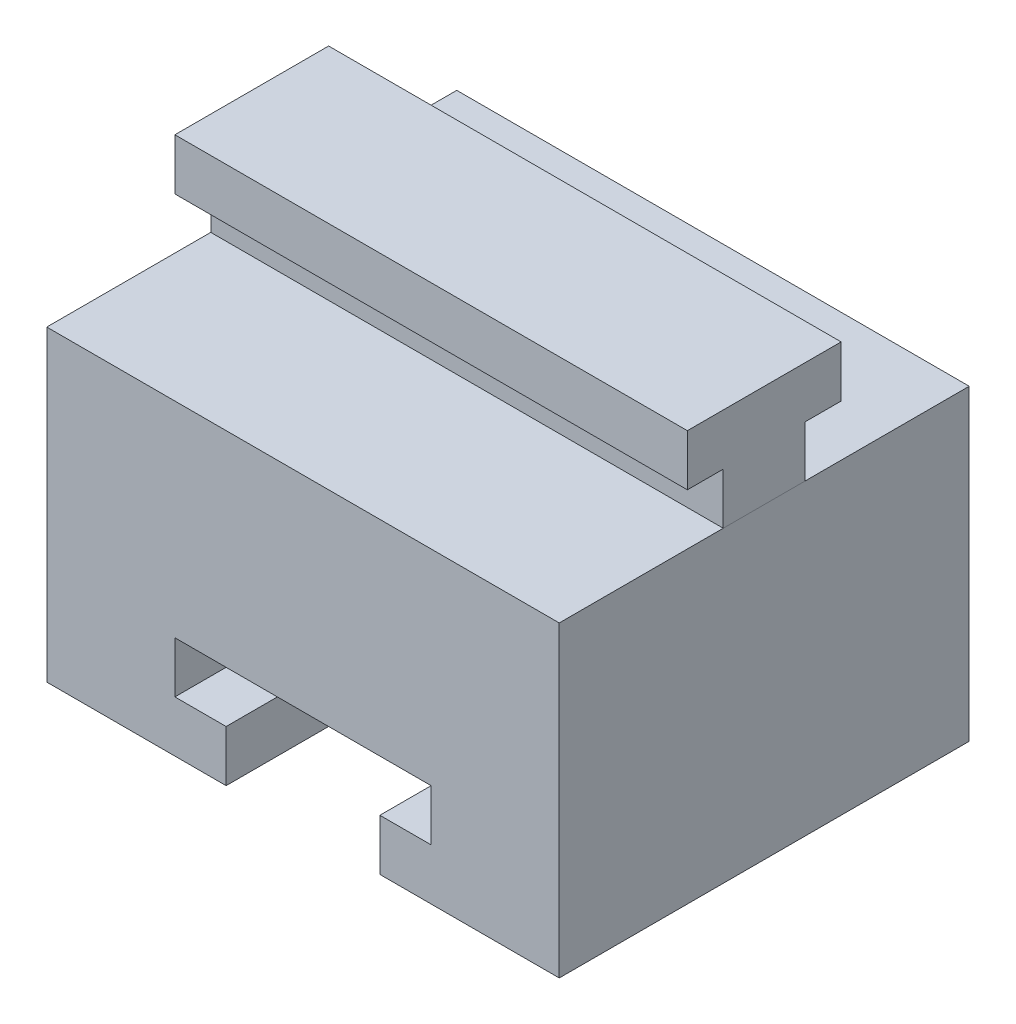
ISO-10303-21;
HEADER;
FILE_DESCRIPTION(('STEP AP214'),'2;1');
FILE_NAME('part.step','',(''),(''),'','','');
FILE_SCHEMA(('AUTOMOTIVE_DESIGN { 1 0 10303 214 1 1 1 1 }'));
ENDSEC;
DATA;
#1=APPLICATION_CONTEXT('core data for automotive mechanical design processes');
#2=APPLICATION_PROTOCOL_DEFINITION('international standard','automotive_design',2000,#1);
#3=PRODUCT_CONTEXT('',#1,'mechanical');
#4=PRODUCT('Part','Part','',(#3));
#5=PRODUCT_RELATED_PRODUCT_CATEGORY('part','',(#4));
#6=PRODUCT_DEFINITION_FORMATION('','',#4);
#7=PRODUCT_DEFINITION_CONTEXT('part definition',#1,'design');
#8=PRODUCT_DEFINITION('design','',#6,#7);
#9=PRODUCT_DEFINITION_SHAPE('','',#8);
#10=(LENGTH_UNIT() NAMED_UNIT(*) SI_UNIT(.MILLI.,.METRE.));
#11=(NAMED_UNIT(*) PLANE_ANGLE_UNIT() SI_UNIT($,.RADIAN.));
#12=(NAMED_UNIT(*) SI_UNIT($,.STERADIAN.) SOLID_ANGLE_UNIT());
#13=UNCERTAINTY_MEASURE_WITH_UNIT(LENGTH_MEASURE(1.E-05),#10,'distance_accuracy_value','');
#14=(GEOMETRIC_REPRESENTATION_CONTEXT(3) GLOBAL_UNCERTAINTY_ASSIGNED_CONTEXT((#13)) GLOBAL_UNIT_ASSIGNED_CONTEXT((#10,
#11,#12)) REPRESENTATION_CONTEXT('',''));
#15=CARTESIAN_POINT('',(0.,0.,0.));
#16=DIRECTION('',(0.,0.,1.));
#17=DIRECTION('',(1.,0.,0.));
#18=AXIS2_PLACEMENT_3D('',#15,#16,#17);
#19=CARTESIAN_POINT('',(12.2857142857143,8.14285714285714,24.));
#20=DIRECTION('',(0.,0.,-1.));
#21=DIRECTION('',(-1.,0.,0.));
#22=AXIS2_PLACEMENT_3D('',#19,#20,#21);
#23=PLANE('',#22);
#24=DIRECTION('',(-1.,0.,0.));
#25=VECTOR('',#24,1.);
#26=CARTESIAN_POINT('',(12.2857142857143,13.1395488489312,24.));
#27=LINE('',#26,#25);
#28=CARTESIAN_POINT('',(12.2857142857143,13.1395488489312,24.));
#29=VERTEX_POINT('',#28);
#30=CARTESIAN_POINT('',(-37.7142857142857,13.1395488489312,24.));
#31=VERTEX_POINT('',#30);
#32=EDGE_CURVE('E129',#29,#31,#27,.T.);
#33=ORIENTED_EDGE('',*,*,#32,.T.);
#34=DIRECTION('',(0.,-1.,0.));
#35=VECTOR('',#34,1.);
#36=CARTESIAN_POINT('',(-37.7142857142857,8.14285714285714,24.));
#37=LINE('',#36,#35);
#38=CARTESIAN_POINT('',(-37.7142857142857,8.14285714285714,24.));
#39=VERTEX_POINT('',#38);
#40=EDGE_CURVE('E123',#31,#39,#37,.T.);
#41=ORIENTED_EDGE('',*,*,#40,.T.);
#42=DIRECTION('',(-1.,0.,0.));
#43=VECTOR('',#42,1.);
#44=CARTESIAN_POINT('',(12.2857142857143,8.14285714285714,24.));
#45=LINE('',#44,#43);
#46=CARTESIAN_POINT('',(12.2857142857143,8.14285714285714,24.));
#47=VERTEX_POINT('',#46);
#48=EDGE_CURVE('E12',#47,#39,#45,.T.);
#49=ORIENTED_EDGE('',*,*,#48,.F.);
#50=DIRECTION('',(0.,-1.,0.));
#51=VECTOR('',#50,1.);
#52=CARTESIAN_POINT('',(12.2857142857143,8.14285714285714,24.));
#53=LINE('',#52,#51);
#54=EDGE_CURVE('E147',#29,#47,#53,.T.);
#55=ORIENTED_EDGE('',*,*,#54,.F.);
#56=EDGE_LOOP('',(#33,#41,#49,#55));
#57=FACE_BOUND('',#56,.T.);
#58=ADVANCED_FACE('F47',(#57),#23,.F.);
#59=CARTESIAN_POINT('',(12.2857142857143,8.14285714285714,24.));
#60=DIRECTION('',(0.,1.,0.));
#61=DIRECTION('',(0.,0.,1.));
#62=AXIS2_PLACEMENT_3D('',#59,#60,#61);
#63=PLANE('',#62);
#64=ORIENTED_EDGE('',*,*,#48,.T.);
#65=DIRECTION('',(0.,0.,-1.));
#66=VECTOR('',#65,1.);
#67=CARTESIAN_POINT('',(-37.7142857142857,8.14285714285714,24.));
#68=LINE('',#67,#66);
#69=CARTESIAN_POINT('',(-37.7142857142857,8.14285714285714,16.));
#70=VERTEX_POINT('',#69);
#71=EDGE_CURVE('E113',#39,#70,#68,.T.);
#72=ORIENTED_EDGE('',*,*,#71,.T.);
#73=DIRECTION('',(-1.,0.,0.));
#74=VECTOR('',#73,1.);
#75=CARTESIAN_POINT('',(12.2857142857143,8.14285714285714,16.));
#76=LINE('',#75,#74);
#77=CARTESIAN_POINT('',(12.2857142857143,8.14285714285714,16.));
#78=VERTEX_POINT('',#77);
#79=EDGE_CURVE('E54',#78,#70,#76,.T.);
#80=ORIENTED_EDGE('',*,*,#79,.F.);
#81=DIRECTION('',(0.,0.,-1.));
#82=VECTOR('',#81,1.);
#83=CARTESIAN_POINT('',(12.2857142857143,8.14285714285714,24.));
#84=LINE('',#83,#82);
#85=EDGE_CURVE('E114',#47,#78,#84,.T.);
#86=ORIENTED_EDGE('',*,*,#85,.F.);
#87=EDGE_LOOP('',(#64,#72,#80,#86));
#88=FACE_BOUND('',#87,.T.);
#89=ADVANCED_FACE('F111',(#88),#63,.F.);
#90=CARTESIAN_POINT('',(12.2857142857143,8.14285714285714,16.));
#91=DIRECTION('',(0.,0.,1.));
#92=DIRECTION('',(1.,0.,0.));
#93=AXIS2_PLACEMENT_3D('',#90,#91,#92);
#94=PLANE('',#93);
#95=ORIENTED_EDGE('',*,*,#79,.T.);
#96=DIRECTION('',(0.,1.,0.));
#97=VECTOR('',#96,1.);
#98=CARTESIAN_POINT('',(-37.7142857142857,8.14285714285714,16.));
#99=LINE('',#98,#97);
#100=CARTESIAN_POINT('',(-37.7142857142857,13.1395488489312,16.));
#101=VERTEX_POINT('',#100);
#102=EDGE_CURVE('E127',#70,#101,#99,.T.);
#103=ORIENTED_EDGE('',*,*,#102,.T.);
#104=DIRECTION('',(-1.,0.,0.));
#105=VECTOR('',#104,1.);
#106=CARTESIAN_POINT('',(12.2857142857143,13.1395488489312,16.));
#107=LINE('',#106,#105);
#108=CARTESIAN_POINT('',(12.2857142857143,13.1395488489312,16.));
#109=VERTEX_POINT('',#108);
#110=EDGE_CURVE('E169',#109,#101,#107,.T.);
#111=ORIENTED_EDGE('',*,*,#110,.F.);
#112=DIRECTION('',(0.,1.,0.));
#113=VECTOR('',#112,1.);
#114=CARTESIAN_POINT('',(12.2857142857143,8.14285714285714,16.));
#115=LINE('',#114,#113);
#116=EDGE_CURVE('E150',#78,#109,#115,.T.);
#117=ORIENTED_EDGE('',*,*,#116,.F.);
#118=EDGE_LOOP('',(#95,#103,#111,#117));
#119=FACE_BOUND('',#118,.T.);
#120=ADVANCED_FACE('F172',(#119),#94,.F.);
#121=CARTESIAN_POINT('',(12.2857142857143,13.1395488489312,16.));
#122=DIRECTION('',(0.,1.,0.));
#123=DIRECTION('',(0.,0.,1.));
#124=AXIS2_PLACEMENT_3D('',#121,#122,#123);
#125=PLANE('',#124);
#126=ORIENTED_EDGE('',*,*,#110,.T.);
#127=DIRECTION('',(0.,0.,-1.));
#128=VECTOR('',#127,1.);
#129=CARTESIAN_POINT('',(-37.7142857142857,13.1395488489312,16.));
#130=LINE('',#129,#128);
#131=CARTESIAN_POINT('',(-37.7142857142857,13.1395488489312,12.5));
#132=VERTEX_POINT('',#131);
#133=EDGE_CURVE('E133',#101,#132,#130,.T.);
#134=ORIENTED_EDGE('',*,*,#133,.T.);
#135=DIRECTION('',(-1.,0.,0.));
#136=VECTOR('',#135,1.);
#137=CARTESIAN_POINT('',(12.2857142857143,13.1395488489312,12.5));
#138=LINE('',#137,#136);
#139=CARTESIAN_POINT('',(12.2857142857143,13.1395488489312,12.5));
#140=VERTEX_POINT('',#139);
#141=EDGE_CURVE('E167',#140,#132,#138,.T.);
#142=ORIENTED_EDGE('',*,*,#141,.F.);
#143=DIRECTION('',(0.,0.,-1.));
#144=VECTOR('',#143,1.);
#145=CARTESIAN_POINT('',(12.2857142857143,13.1395488489312,16.));
#146=LINE('',#145,#144);
#147=EDGE_CURVE('E152',#109,#140,#146,.T.);
#148=ORIENTED_EDGE('',*,*,#147,.F.);
#149=EDGE_LOOP('',(#126,#134,#142,#148));
#150=FACE_BOUND('',#149,.T.);
#151=ADVANCED_FACE('F180',(#150),#125,.F.);
#152=CARTESIAN_POINT('',(12.2857142857143,13.1395488489312,12.5));
#153=DIRECTION('',(0.,0.,1.));
#154=DIRECTION('',(1.,0.,0.));
#155=AXIS2_PLACEMENT_3D('',#152,#153,#154);
#156=PLANE('',#155);
#157=ORIENTED_EDGE('',*,*,#141,.T.);
#158=DIRECTION('',(0.,1.,0.));
#159=VECTOR('',#158,1.);
#160=CARTESIAN_POINT('',(-37.7142857142857,13.1395488489312,12.5));
#161=LINE('',#160,#159);
#162=CARTESIAN_POINT('',(-37.7142857142857,18.1395488489312,12.5));
#163=VERTEX_POINT('',#162);
#164=EDGE_CURVE('E136',#132,#163,#161,.T.);
#165=ORIENTED_EDGE('',*,*,#164,.T.);
#166=DIRECTION('',(-1.,0.,0.));
#167=VECTOR('',#166,1.);
#168=CARTESIAN_POINT('',(12.2857142857143,18.1395488489312,12.5));
#169=LINE('',#168,#167);
#170=CARTESIAN_POINT('',(12.2857142857143,18.1395488489312,12.5));
#171=VERTEX_POINT('',#170);
#172=EDGE_CURVE('E165',#171,#163,#169,.T.);
#173=ORIENTED_EDGE('',*,*,#172,.F.);
#174=DIRECTION('',(0.,1.,0.));
#175=VECTOR('',#174,1.);
#176=CARTESIAN_POINT('',(12.2857142857143,13.1395488489312,12.5));
#177=LINE('',#176,#175);
#178=EDGE_CURVE('E154',#140,#171,#177,.T.);
#179=ORIENTED_EDGE('',*,*,#178,.F.);
#180=EDGE_LOOP('',(#157,#165,#173,#179));
#181=FACE_BOUND('',#180,.T.);
#182=ADVANCED_FACE('F183',(#181),#156,.F.);
#183=CARTESIAN_POINT('',(12.2857142857143,18.1395488489312,12.5));
#184=DIRECTION('',(0.,-1.,0.));
#185=DIRECTION('',(0.,0.,-1.));
#186=AXIS2_PLACEMENT_3D('',#183,#184,#185);
#187=PLANE('',#186);
#188=ORIENTED_EDGE('',*,*,#172,.T.);
#189=DIRECTION('',(0.,0.,1.));
#190=VECTOR('',#189,1.);
#191=CARTESIAN_POINT('',(-37.7142857142857,18.1395488489312,12.5));
#192=LINE('',#191,#190);
#193=CARTESIAN_POINT('',(-37.7142857142857,18.1395488489312,27.5));
#194=VERTEX_POINT('',#193);
#195=EDGE_CURVE('E139',#163,#194,#192,.T.);
#196=ORIENTED_EDGE('',*,*,#195,.T.);
#197=DIRECTION('',(-1.,0.,0.));
#198=VECTOR('',#197,1.);
#199=CARTESIAN_POINT('',(12.2857142857143,18.1395488489312,27.5));
#200=LINE('',#199,#198);
#201=CARTESIAN_POINT('',(12.2857142857143,18.1395488489312,27.5));
#202=VERTEX_POINT('',#201);
#203=EDGE_CURVE('E163',#202,#194,#200,.T.);
#204=ORIENTED_EDGE('',*,*,#203,.F.);
#205=DIRECTION('',(0.,0.,1.));
#206=VECTOR('',#205,1.);
#207=CARTESIAN_POINT('',(12.2857142857143,18.1395488489312,12.5));
#208=LINE('',#207,#206);
#209=EDGE_CURVE('E156',#171,#202,#208,.T.);
#210=ORIENTED_EDGE('',*,*,#209,.F.);
#211=EDGE_LOOP('',(#188,#196,#204,#210));
#212=FACE_BOUND('',#211,.T.);
#213=ADVANCED_FACE('F188',(#212),#187,.F.);
#214=CARTESIAN_POINT('',(12.2857142857143,13.1395488489312,27.5));
#215=DIRECTION('',(0.,0.,-1.));
#216=DIRECTION('',(-1.,0.,0.));
#217=AXIS2_PLACEMENT_3D('',#214,#215,#216);
#218=PLANE('',#217);
#219=ORIENTED_EDGE('',*,*,#203,.T.);
#220=DIRECTION('',(0.,-1.,0.));
#221=VECTOR('',#220,1.);
#222=CARTESIAN_POINT('',(-37.7142857142857,13.1395488489312,27.5));
#223=LINE('',#222,#221);
#224=CARTESIAN_POINT('',(-37.7142857142857,13.1395488489312,27.5));
#225=VERTEX_POINT('',#224);
#226=EDGE_CURVE('E142',#194,#225,#223,.T.);
#227=ORIENTED_EDGE('',*,*,#226,.T.);
#228=DIRECTION('',(-1.,0.,0.));
#229=VECTOR('',#228,1.);
#230=CARTESIAN_POINT('',(12.2857142857143,13.1395488489312,27.5));
#231=LINE('',#230,#229);
#232=CARTESIAN_POINT('',(12.2857142857143,13.1395488489312,27.5));
#233=VERTEX_POINT('',#232);
#234=EDGE_CURVE('E161',#233,#225,#231,.T.);
#235=ORIENTED_EDGE('',*,*,#234,.F.);
#236=DIRECTION('',(0.,-1.,0.));
#237=VECTOR('',#236,1.);
#238=CARTESIAN_POINT('',(12.2857142857143,13.1395488489312,27.5));
#239=LINE('',#238,#237);
#240=EDGE_CURVE('E66',#202,#233,#239,.T.);
#241=ORIENTED_EDGE('',*,*,#240,.F.);
#242=EDGE_LOOP('',(#219,#227,#235,#241));
#243=FACE_BOUND('',#242,.T.);
#244=ADVANCED_FACE('F191',(#243),#218,.F.);
#245=CARTESIAN_POINT('',(12.2857142857143,13.1395488489312,24.));
#246=DIRECTION('',(0.,1.,0.));
#247=DIRECTION('',(0.,0.,1.));
#248=AXIS2_PLACEMENT_3D('',#245,#246,#247);
#249=PLANE('',#248);
#250=ORIENTED_EDGE('',*,*,#234,.T.);
#251=DIRECTION('',(0.,0.,-1.));
#252=VECTOR('',#251,1.);
#253=CARTESIAN_POINT('',(-37.7142857142857,13.1395488489312,24.));
#254=LINE('',#253,#252);
#255=EDGE_CURVE('E145',#225,#31,#254,.T.);
#256=ORIENTED_EDGE('',*,*,#255,.T.);
#257=ORIENTED_EDGE('',*,*,#32,.F.);
#258=DIRECTION('',(0.,0.,-1.));
#259=VECTOR('',#258,1.);
#260=CARTESIAN_POINT('',(12.2857142857143,13.1395488489312,24.));
#261=LINE('',#260,#259);
#262=EDGE_CURVE('E61',#233,#29,#261,.T.);
#263=ORIENTED_EDGE('',*,*,#262,.F.);
#264=EDGE_LOOP('',(#250,#256,#257,#263));
#265=FACE_BOUND('',#264,.T.);
#266=ADVANCED_FACE('F193',(#265),#249,.F.);
#267=CARTESIAN_POINT('',(12.2857142857143,0.,0.));
#268=DIRECTION('',(1.,0.,0.));
#269=DIRECTION('',(0.,0.,-1.));
#270=AXIS2_PLACEMENT_3D('',#267,#268,#269);
#271=PLANE('',#270);
#272=ORIENTED_EDGE('',*,*,#54,.T.);
#273=ORIENTED_EDGE('',*,*,#85,.T.);
#274=ORIENTED_EDGE('',*,*,#116,.T.);
#275=ORIENTED_EDGE('',*,*,#147,.T.);
#276=ORIENTED_EDGE('',*,*,#178,.T.);
#277=ORIENTED_EDGE('',*,*,#209,.T.);
#278=ORIENTED_EDGE('',*,*,#240,.T.);
#279=ORIENTED_EDGE('',*,*,#262,.T.);
#280=EDGE_LOOP('',(#272,#273,#274,#275,#276,#277,#278,#279));
#281=FACE_BOUND('',#280,.T.);
#282=ADVANCED_FACE('F175',(#281),#271,.T.);
#283=CARTESIAN_POINT('',(-37.7142857142857,0.,0.));
#284=DIRECTION('',(1.,0.,0.));
#285=DIRECTION('',(0.,0.,-1.));
#286=AXIS2_PLACEMENT_3D('',#283,#284,#285);
#287=PLANE('',#286);
#288=ORIENTED_EDGE('',*,*,#40,.F.);
#289=ORIENTED_EDGE('',*,*,#255,.F.);
#290=ORIENTED_EDGE('',*,*,#226,.F.);
#291=ORIENTED_EDGE('',*,*,#195,.F.);
#292=ORIENTED_EDGE('',*,*,#164,.F.);
#293=ORIENTED_EDGE('',*,*,#133,.F.);
#294=ORIENTED_EDGE('',*,*,#102,.F.);
#295=ORIENTED_EDGE('',*,*,#71,.F.);
#296=EDGE_LOOP('',(#288,#289,#290,#291,#292,#293,#294,#295));
#297=FACE_BOUND('',#296,.T.);
#298=ADVANCED_FACE('F121',(#297),#287,.F.);
#299=CLOSED_SHELL('',(#58,#89,#120,#151,#182,#213,#244,#266,#282,#298));
#300=MANIFOLD_SOLID_BREP('B2',#299);
#301=CARTESIAN_POINT('',(-37.7142857142857,-21.8571428571429,40.));
#302=DIRECTION('',(0.,1.,0.));
#303=DIRECTION('',(0.,0.,1.));
#304=AXIS2_PLACEMENT_3D('',#301,#302,#303);
#305=PLANE('',#304);
#306=DIRECTION('',(0.,0.,-1.));
#307=VECTOR('',#306,1.);
#308=CARTESIAN_POINT('',(-20.2142857142857,-21.8571428571429,178.388347648318));
#309=LINE('',#308,#307);
#310=CARTESIAN_POINT('',(-20.2142857142857,-21.8571428571429,40.));
#311=VERTEX_POINT('',#310);
#312=CARTESIAN_POINT('',(-20.2142857142857,-21.8571428571429,0.));
#313=VERTEX_POINT('',#312);
#314=EDGE_CURVE('E391',#311,#313,#309,.T.);
#315=ORIENTED_EDGE('',*,*,#314,.F.);
#316=DIRECTION('',(1.,0.,0.));
#317=VECTOR('',#316,1.);
#318=CARTESIAN_POINT('',(-37.7142857142857,-21.8571428571429,40.));
#319=LINE('',#318,#317);
#320=CARTESIAN_POINT('',(-37.7142857142857,-21.8571428571429,40.));
#321=VERTEX_POINT('',#320);
#322=EDGE_CURVE('E328',#321,#311,#319,.T.);
#323=ORIENTED_EDGE('',*,*,#322,.F.);
#324=DIRECTION('',(0.,0.,-1.));
#325=VECTOR('',#324,1.);
#326=CARTESIAN_POINT('',(-37.7142857142857,-21.8571428571429,40.));
#327=LINE('',#326,#325);
#328=CARTESIAN_POINT('',(-37.7142857142857,-21.8571428571429,0.));
#329=VERTEX_POINT('',#328);
#330=EDGE_CURVE('E421',#321,#329,#327,.T.);
#331=ORIENTED_EDGE('',*,*,#330,.T.);
#332=DIRECTION('',(1.,0.,0.));
#333=VECTOR('',#332,1.);
#334=CARTESIAN_POINT('',(-37.7142857142857,-21.8571428571429,0.));
#335=LINE('',#334,#333);
#336=EDGE_CURVE('E411',#329,#313,#335,.T.);
#337=ORIENTED_EDGE('',*,*,#336,.T.);
#338=EDGE_LOOP('',(#315,#323,#331,#337));
#339=FACE_BOUND('',#338,.T.);
#340=ADVANCED_FACE('F275',(#339),#305,.F.);
#341=CARTESIAN_POINT('',(-37.7142857142857,8.14285714285714,40.));
#342=DIRECTION('',(1.,0.,0.));
#343=DIRECTION('',(0.,0.,-1.));
#344=AXIS2_PLACEMENT_3D('',#341,#342,#343);
#345=PLANE('',#344);
#346=DIRECTION('',(0.,-1.,0.));
#347=VECTOR('',#346,1.);
#348=CARTESIAN_POINT('',(-37.7142857142857,8.14285714285714,0.));
#349=LINE('',#348,#347);
#350=CARTESIAN_POINT('',(-37.7142857142857,8.14285714285714,0.));
#351=VERTEX_POINT('',#350);
#352=EDGE_CURVE('E406',#351,#329,#349,.T.);
#353=ORIENTED_EDGE('',*,*,#352,.T.);
#354=ORIENTED_EDGE('',*,*,#330,.F.);
#355=DIRECTION('',(0.,-1.,0.));
#356=VECTOR('',#355,1.);
#357=CARTESIAN_POINT('',(-37.7142857142857,8.14285714285714,40.));
#358=LINE('',#357,#356);
#359=CARTESIAN_POINT('',(-37.7142857142857,8.14285714285714,40.));
#360=VERTEX_POINT('',#359);
#361=EDGE_CURVE('E397',#360,#321,#358,.T.);
#362=ORIENTED_EDGE('',*,*,#361,.F.);
#363=DIRECTION('',(0.,0.,-1.));
#364=VECTOR('',#363,1.);
#365=CARTESIAN_POINT('',(-37.7142857142857,8.14285714285714,40.));
#366=LINE('',#365,#364);
#367=EDGE_CURVE('E405',#360,#351,#366,.T.);
#368=ORIENTED_EDGE('',*,*,#367,.T.);
#369=EDGE_LOOP('',(#353,#354,#362,#368));
#370=FACE_BOUND('',#369,.T.);
#371=ADVANCED_FACE('F277',(#370),#345,.F.);
#372=CARTESIAN_POINT('',(-5.21428571428569,-21.8571428571429,40.));
#373=VERTEX_POINT('',#372);
#374=CARTESIAN_POINT('',(12.2857142857143,-21.8571428571429,40.));
#375=VERTEX_POINT('',#374);
#376=EDGE_CURVE('E387',#373,#375,#319,.T.);
#377=ORIENTED_EDGE('',*,*,#376,.F.);
#378=DIRECTION('',(0.,0.,-1.));
#379=VECTOR('',#378,1.);
#380=CARTESIAN_POINT('',(-5.21428571428569,-21.8571428571429,178.388347648318));
#381=LINE('',#380,#379);
#382=CARTESIAN_POINT('',(-5.21428571428569,-21.8571428571429,0.));
#383=VERTEX_POINT('',#382);
#384=EDGE_CURVE('E373',#373,#383,#381,.T.);
#385=ORIENTED_EDGE('',*,*,#384,.T.);
#386=CARTESIAN_POINT('',(12.2857142857143,-21.8571428571429,0.));
#387=VERTEX_POINT('',#386);
#388=EDGE_CURVE('E409',#383,#387,#335,.T.);
#389=ORIENTED_EDGE('',*,*,#388,.T.);
#390=DIRECTION('',(0.,0.,-1.));
#391=VECTOR('',#390,1.);
#392=CARTESIAN_POINT('',(12.2857142857143,-21.8571428571429,40.));
#393=LINE('',#392,#391);
#394=EDGE_CURVE('E395',#375,#387,#393,.T.);
#395=ORIENTED_EDGE('',*,*,#394,.F.);
#396=EDGE_LOOP('',(#377,#385,#389,#395));
#397=FACE_BOUND('',#396,.T.);
#398=ADVANCED_FACE('F393',(#397),#305,.F.);
#399=CARTESIAN_POINT('',(12.2857142857143,8.14285714285714,40.));
#400=DIRECTION('',(-1.,0.,0.));
#401=DIRECTION('',(0.,-1.,0.));
#402=AXIS2_PLACEMENT_3D('',#399,#400,#401);
#403=PLANE('',#402);
#404=DIRECTION('',(0.,1.,0.));
#405=VECTOR('',#404,1.);
#406=CARTESIAN_POINT('',(12.2857142857143,8.14285714285714,0.));
#407=LINE('',#406,#405);
#408=CARTESIAN_POINT('',(12.2857142857143,8.14285714285714,0.));
#409=VERTEX_POINT('',#408);
#410=EDGE_CURVE('E414',#387,#409,#407,.T.);
#411=ORIENTED_EDGE('',*,*,#410,.T.);
#412=DIRECTION('',(0.,0.,-1.));
#413=VECTOR('',#412,1.);
#414=CARTESIAN_POINT('',(12.2857142857143,8.14285714285714,40.));
#415=LINE('',#414,#413);
#416=CARTESIAN_POINT('',(12.2857142857143,8.14285714285714,40.));
#417=VERTEX_POINT('',#416);
#418=EDGE_CURVE('E418',#417,#409,#415,.T.);
#419=ORIENTED_EDGE('',*,*,#418,.F.);
#420=DIRECTION('',(0.,1.,0.));
#421=VECTOR('',#420,1.);
#422=CARTESIAN_POINT('',(12.2857142857143,8.14285714285714,40.));
#423=LINE('',#422,#421);
#424=EDGE_CURVE('E399',#375,#417,#423,.T.);
#425=ORIENTED_EDGE('',*,*,#424,.F.);
#426=ORIENTED_EDGE('',*,*,#394,.T.);
#427=EDGE_LOOP('',(#411,#419,#425,#426));
#428=FACE_BOUND('',#427,.T.);
#429=ADVANCED_FACE('F477',(#428),#403,.F.);
#430=CARTESIAN_POINT('',(-37.7142857142857,8.14285714285714,40.));
#431=DIRECTION('',(0.,-1.,0.));
#432=DIRECTION('',(0.,0.,-1.));
#433=AXIS2_PLACEMENT_3D('',#430,#431,#432);
#434=PLANE('',#433);
#435=DIRECTION('',(-1.,0.,0.));
#436=VECTOR('',#435,1.);
#437=CARTESIAN_POINT('',(-37.7142857142857,8.14285714285714,0.));
#438=LINE('',#437,#436);
#439=EDGE_CURVE('E320',#409,#351,#438,.T.);
#440=ORIENTED_EDGE('',*,*,#439,.T.);
#441=ORIENTED_EDGE('',*,*,#367,.F.);
#442=DIRECTION('',(-1.,0.,0.));
#443=VECTOR('',#442,1.);
#444=CARTESIAN_POINT('',(-37.7142857142857,8.14285714285714,40.));
#445=LINE('',#444,#443);
#446=EDGE_CURVE('E299',#417,#360,#445,.T.);
#447=ORIENTED_EDGE('',*,*,#446,.F.);
#448=ORIENTED_EDGE('',*,*,#418,.T.);
#449=EDGE_LOOP('',(#440,#441,#447,#448));
#450=FACE_BOUND('',#449,.T.);
#451=ADVANCED_FACE('F478',(#450),#434,.F.);
#452=CARTESIAN_POINT('',(0.,0.,40.));
#453=DIRECTION('',(0.,0.,1.));
#454=DIRECTION('',(1.,0.,0.));
#455=AXIS2_PLACEMENT_3D('',#452,#453,#454);
#456=PLANE('',#455);
#457=DIRECTION('',(0.,-1.,0.));
#458=VECTOR('',#457,1.);
#459=CARTESIAN_POINT('',(-20.2142857142857,0.,40.));
#460=LINE('',#459,#458);
#461=CARTESIAN_POINT('',(-20.2142857142857,-16.8571428571429,40.));
#462=VERTEX_POINT('',#461);
#463=EDGE_CURVE('E410',#462,#311,#460,.T.);
#464=ORIENTED_EDGE('',*,*,#463,.F.);
#465=DIRECTION('',(1.,0.,0.));
#466=VECTOR('',#465,1.);
#467=CARTESIAN_POINT('',(0.,-16.8571428571428,40.));
#468=LINE('',#467,#466);
#469=CARTESIAN_POINT('',(-25.2142857142857,-16.8571428571429,40.));
#470=VERTEX_POINT('',#469);
#471=EDGE_CURVE('E467',#470,#462,#468,.T.);
#472=ORIENTED_EDGE('',*,*,#471,.F.);
#473=DIRECTION('',(0.,-1.,0.));
#474=VECTOR('',#473,1.);
#475=CARTESIAN_POINT('',(-25.2142857142857,0.,40.));
#476=LINE('',#475,#474);
#477=CARTESIAN_POINT('',(-25.2142857142857,-11.8571428571429,40.));
#478=VERTEX_POINT('',#477);
#479=EDGE_CURVE('E452',#478,#470,#476,.T.);
#480=ORIENTED_EDGE('',*,*,#479,.F.);
#481=DIRECTION('',(-1.,0.,0.));
#482=VECTOR('',#481,1.);
#483=CARTESIAN_POINT('',(0.,-11.8571428571429,40.));
#484=LINE('',#483,#482);
#485=CARTESIAN_POINT('',(-0.214285714285691,-11.8571428571429,40.));
#486=VERTEX_POINT('',#485);
#487=EDGE_CURVE('E464',#486,#478,#484,.T.);
#488=ORIENTED_EDGE('',*,*,#487,.F.);
#489=DIRECTION('',(0.,1.,0.));
#490=VECTOR('',#489,1.);
#491=CARTESIAN_POINT('',(-0.214285714285691,0.,40.));
#492=LINE('',#491,#490);
#493=CARTESIAN_POINT('',(-0.214285714285691,-16.8571428571429,40.));
#494=VERTEX_POINT('',#493);
#495=EDGE_CURVE('E462',#494,#486,#492,.T.);
#496=ORIENTED_EDGE('',*,*,#495,.F.);
#497=DIRECTION('',(1.,0.,0.));
#498=VECTOR('',#497,1.);
#499=CARTESIAN_POINT('',(0.,-16.8571428571429,40.));
#500=LINE('',#499,#498);
#501=CARTESIAN_POINT('',(-5.21428571428569,-16.8571428571429,40.));
#502=VERTEX_POINT('',#501);
#503=EDGE_CURVE('E390',#502,#494,#500,.T.);
#504=ORIENTED_EDGE('',*,*,#503,.F.);
#505=DIRECTION('',(0.,1.,0.));
#506=VECTOR('',#505,1.);
#507=CARTESIAN_POINT('',(-5.21428571428569,0.,40.));
#508=LINE('',#507,#506);
#509=EDGE_CURVE('E376',#373,#502,#508,.T.);
#510=ORIENTED_EDGE('',*,*,#509,.F.);
#511=ORIENTED_EDGE('',*,*,#376,.T.);
#512=ORIENTED_EDGE('',*,*,#424,.T.);
#513=ORIENTED_EDGE('',*,*,#446,.T.);
#514=ORIENTED_EDGE('',*,*,#361,.T.);
#515=ORIENTED_EDGE('',*,*,#322,.T.);
#516=EDGE_LOOP('',(#464,#472,#480,#488,#496,#504,#510,#511,#512,#513,#514,#515));
#517=FACE_BOUND('',#516,.T.);
#518=ADVANCED_FACE('F386',(#517),#456,.T.);
#519=CARTESIAN_POINT('',(0.,0.,0.));
#520=DIRECTION('',(0.,0.,1.));
#521=DIRECTION('',(1.,0.,0.));
#522=AXIS2_PLACEMENT_3D('',#519,#520,#521);
#523=PLANE('',#522);
#524=DIRECTION('',(1.,0.,0.));
#525=VECTOR('',#524,1.);
#526=CARTESIAN_POINT('',(0.,-16.8571428571428,0.));
#527=LINE('',#526,#525);
#528=CARTESIAN_POINT('',(-25.2142857142857,-16.8571428571429,0.));
#529=VERTEX_POINT('',#528);
#530=CARTESIAN_POINT('',(-20.2142857142857,-16.8571428571429,0.));
#531=VERTEX_POINT('',#530);
#532=EDGE_CURVE('E283',#529,#531,#527,.T.);
#533=ORIENTED_EDGE('',*,*,#532,.T.);
#534=DIRECTION('',(0.,-1.,0.));
#535=VECTOR('',#534,1.);
#536=CARTESIAN_POINT('',(-20.2142857142857,0.,0.));
#537=LINE('',#536,#535);
#538=EDGE_CURVE('E45',#531,#313,#537,.T.);
#539=ORIENTED_EDGE('',*,*,#538,.T.);
#540=ORIENTED_EDGE('',*,*,#336,.F.);
#541=ORIENTED_EDGE('',*,*,#352,.F.);
#542=ORIENTED_EDGE('',*,*,#439,.F.);
#543=ORIENTED_EDGE('',*,*,#410,.F.);
#544=ORIENTED_EDGE('',*,*,#388,.F.);
#545=DIRECTION('',(0.,1.,0.));
#546=VECTOR('',#545,1.);
#547=CARTESIAN_POINT('',(-5.21428571428569,0.,0.));
#548=LINE('',#547,#546);
#549=CARTESIAN_POINT('',(-5.21428571428569,-16.8571428571429,0.));
#550=VERTEX_POINT('',#549);
#551=EDGE_CURVE('E378',#383,#550,#548,.T.);
#552=ORIENTED_EDGE('',*,*,#551,.T.);
#553=DIRECTION('',(1.,0.,0.));
#554=VECTOR('',#553,1.);
#555=CARTESIAN_POINT('',(0.,-16.8571428571429,0.));
#556=LINE('',#555,#554);
#557=CARTESIAN_POINT('',(-0.214285714285691,-16.8571428571429,0.));
#558=VERTEX_POINT('',#557);
#559=EDGE_CURVE('E424',#550,#558,#556,.T.);
#560=ORIENTED_EDGE('',*,*,#559,.T.);
#561=DIRECTION('',(0.,1.,0.));
#562=VECTOR('',#561,1.);
#563=CARTESIAN_POINT('',(-0.214285714285691,0.,0.));
#564=LINE('',#563,#562);
#565=CARTESIAN_POINT('',(-0.214285714285691,-11.8571428571429,0.));
#566=VERTEX_POINT('',#565);
#567=EDGE_CURVE('E427',#558,#566,#564,.T.);
#568=ORIENTED_EDGE('',*,*,#567,.T.);
#569=DIRECTION('',(-1.,0.,0.));
#570=VECTOR('',#569,1.);
#571=CARTESIAN_POINT('',(0.,-11.8571428571429,0.));
#572=LINE('',#571,#570);
#573=CARTESIAN_POINT('',(-25.2142857142857,-11.8571428571429,0.));
#574=VERTEX_POINT('',#573);
#575=EDGE_CURVE('E430',#566,#574,#572,.T.);
#576=ORIENTED_EDGE('',*,*,#575,.T.);
#577=DIRECTION('',(0.,-1.,0.));
#578=VECTOR('',#577,1.);
#579=CARTESIAN_POINT('',(-25.2142857142857,0.,0.));
#580=LINE('',#579,#578);
#581=EDGE_CURVE('E433',#574,#529,#580,.T.);
#582=ORIENTED_EDGE('',*,*,#581,.T.);
#583=EDGE_LOOP('',(#533,#539,#540,#541,#542,#543,#544,#552,#560,#568,#576,#582));
#584=FACE_BOUND('',#583,.T.);
#585=ADVANCED_FACE('F437',(#584),#523,.F.);
#586=CARTESIAN_POINT('',(-20.2142857142857,-21.8571428571429,178.388347648318));
#587=DIRECTION('',(-1.,0.,0.));
#588=DIRECTION('',(0.,0.,1.));
#589=AXIS2_PLACEMENT_3D('',#586,#587,#588);
#590=PLANE('',#589);
#591=DIRECTION('',(0.,0.,-1.));
#592=VECTOR('',#591,1.);
#593=CARTESIAN_POINT('',(-20.2142857142857,-16.8571428571429,178.388347648318));
#594=LINE('',#593,#592);
#595=EDGE_CURVE('E446',#462,#531,#594,.T.);
#596=ORIENTED_EDGE('',*,*,#595,.F.);
#597=ORIENTED_EDGE('',*,*,#463,.T.);
#598=ORIENTED_EDGE('',*,*,#314,.T.);
#599=ORIENTED_EDGE('',*,*,#538,.F.);
#600=EDGE_LOOP('',(#596,#597,#598,#599));
#601=FACE_BOUND('',#600,.T.);
#602=ADVANCED_FACE('F469',(#601),#590,.F.);
#603=CARTESIAN_POINT('',(-20.2142857142857,-16.8571428571429,178.388347648318));
#604=DIRECTION('',(0.,-1.,0.));
#605=DIRECTION('',(1.,0.,0.));
#606=AXIS2_PLACEMENT_3D('',#603,#604,#605);
#607=PLANE('',#606);
#608=DIRECTION('',(0.,0.,-1.));
#609=VECTOR('',#608,1.);
#610=CARTESIAN_POINT('',(-25.2142857142857,-16.8571428571429,178.388347648318));
#611=LINE('',#610,#609);
#612=EDGE_CURVE('E443',#470,#529,#611,.T.);
#613=ORIENTED_EDGE('',*,*,#612,.F.);
#614=ORIENTED_EDGE('',*,*,#471,.T.);
#615=ORIENTED_EDGE('',*,*,#595,.T.);
#616=ORIENTED_EDGE('',*,*,#532,.F.);
#617=EDGE_LOOP('',(#613,#614,#615,#616));
#618=FACE_BOUND('',#617,.T.);
#619=ADVANCED_FACE('F442',(#618),#607,.F.);
#620=CARTESIAN_POINT('',(-25.2142857142857,-16.8571428571429,178.388347648318));
#621=DIRECTION('',(-1.,0.,0.));
#622=DIRECTION('',(0.,0.,1.));
#623=AXIS2_PLACEMENT_3D('',#620,#621,#622);
#624=PLANE('',#623);
#625=DIRECTION('',(0.,0.,-1.));
#626=VECTOR('',#625,1.);
#627=CARTESIAN_POINT('',(-25.2142857142857,-11.8571428571429,178.388347648318));
#628=LINE('',#627,#626);
#629=EDGE_CURVE('E453',#478,#574,#628,.T.);
#630=ORIENTED_EDGE('',*,*,#629,.F.);
#631=ORIENTED_EDGE('',*,*,#479,.T.);
#632=ORIENTED_EDGE('',*,*,#612,.T.);
#633=ORIENTED_EDGE('',*,*,#581,.F.);
#634=EDGE_LOOP('',(#630,#631,#632,#633));
#635=FACE_BOUND('',#634,.T.);
#636=ADVANCED_FACE('F449',(#635),#624,.F.);
#637=CARTESIAN_POINT('',(-25.2142857142857,-11.8571428571429,178.388347648318));
#638=DIRECTION('',(0.,1.,0.));
#639=DIRECTION('',(0.,0.,1.));
#640=AXIS2_PLACEMENT_3D('',#637,#638,#639);
#641=PLANE('',#640);
#642=DIRECTION('',(0.,0.,-1.));
#643=VECTOR('',#642,1.);
#644=CARTESIAN_POINT('',(-0.214285714285691,-11.8571428571429,178.388347648318));
#645=LINE('',#644,#643);
#646=EDGE_CURVE('E456',#486,#566,#645,.T.);
#647=ORIENTED_EDGE('',*,*,#646,.F.);
#648=ORIENTED_EDGE('',*,*,#487,.T.);
#649=ORIENTED_EDGE('',*,*,#629,.T.);
#650=ORIENTED_EDGE('',*,*,#575,.F.);
#651=EDGE_LOOP('',(#647,#648,#649,#650));
#652=FACE_BOUND('',#651,.T.);
#653=ADVANCED_FACE('F541',(#652),#641,.F.);
#654=CARTESIAN_POINT('',(-0.214285714285691,-11.8571428571429,178.388347648318));
#655=DIRECTION('',(1.,0.,0.));
#656=DIRECTION('',(0.,0.,-1.));
#657=AXIS2_PLACEMENT_3D('',#654,#655,#656);
#658=PLANE('',#657);
#659=DIRECTION('',(0.,0.,-1.));
#660=VECTOR('',#659,1.);
#661=CARTESIAN_POINT('',(-0.214285714285691,-16.8571428571429,178.388347648318));
#662=LINE('',#661,#660);
#663=EDGE_CURVE('E382',#494,#558,#662,.T.);
#664=ORIENTED_EDGE('',*,*,#663,.F.);
#665=ORIENTED_EDGE('',*,*,#495,.T.);
#666=ORIENTED_EDGE('',*,*,#646,.T.);
#667=ORIENTED_EDGE('',*,*,#567,.F.);
#668=EDGE_LOOP('',(#664,#665,#666,#667));
#669=FACE_BOUND('',#668,.T.);
#670=ADVANCED_FACE('F549',(#669),#658,.F.);
#671=CARTESIAN_POINT('',(-0.214285714285691,-16.8571428571429,178.388347648318));
#672=DIRECTION('',(0.,-1.,0.));
#673=DIRECTION('',(0.,0.,-1.));
#674=AXIS2_PLACEMENT_3D('',#671,#672,#673);
#675=PLANE('',#674);
#676=DIRECTION('',(0.,0.,-1.));
#677=VECTOR('',#676,1.);
#678=CARTESIAN_POINT('',(-5.21428571428569,-16.8571428571429,178.388347648318));
#679=LINE('',#678,#677);
#680=EDGE_CURVE('E290',#502,#550,#679,.T.);
#681=ORIENTED_EDGE('',*,*,#680,.F.);
#682=ORIENTED_EDGE('',*,*,#503,.T.);
#683=ORIENTED_EDGE('',*,*,#663,.T.);
#684=ORIENTED_EDGE('',*,*,#559,.F.);
#685=EDGE_LOOP('',(#681,#682,#683,#684));
#686=FACE_BOUND('',#685,.T.);
#687=ADVANCED_FACE('F558',(#686),#675,.F.);
#688=CARTESIAN_POINT('',(-5.21428571428569,-16.8571428571429,178.388347648318));
#689=DIRECTION('',(1.,0.,0.));
#690=DIRECTION('',(0.,0.,-1.));
#691=AXIS2_PLACEMENT_3D('',#688,#689,#690);
#692=PLANE('',#691);
#693=ORIENTED_EDGE('',*,*,#384,.F.);
#694=ORIENTED_EDGE('',*,*,#509,.T.);
#695=ORIENTED_EDGE('',*,*,#680,.T.);
#696=ORIENTED_EDGE('',*,*,#551,.F.);
#697=EDGE_LOOP('',(#693,#694,#695,#696));
#698=FACE_BOUND('',#697,.T.);
#699=ADVANCED_FACE('F375',(#698),#692,.F.);
#700=CLOSED_SHELL('',(#340,#371,#398,#429,#451,#518,#585,#602,#619,#636,#653,#670,#687,#699));
#701=MANIFOLD_SOLID_BREP('B6',#700);
#702=ADVANCED_BREP_SHAPE_REPRESENTATION('',(#18,#300,#701),#14);
#703=SHAPE_DEFINITION_REPRESENTATION(#9,#702);
ENDSEC;
END-ISO-10303-21;
